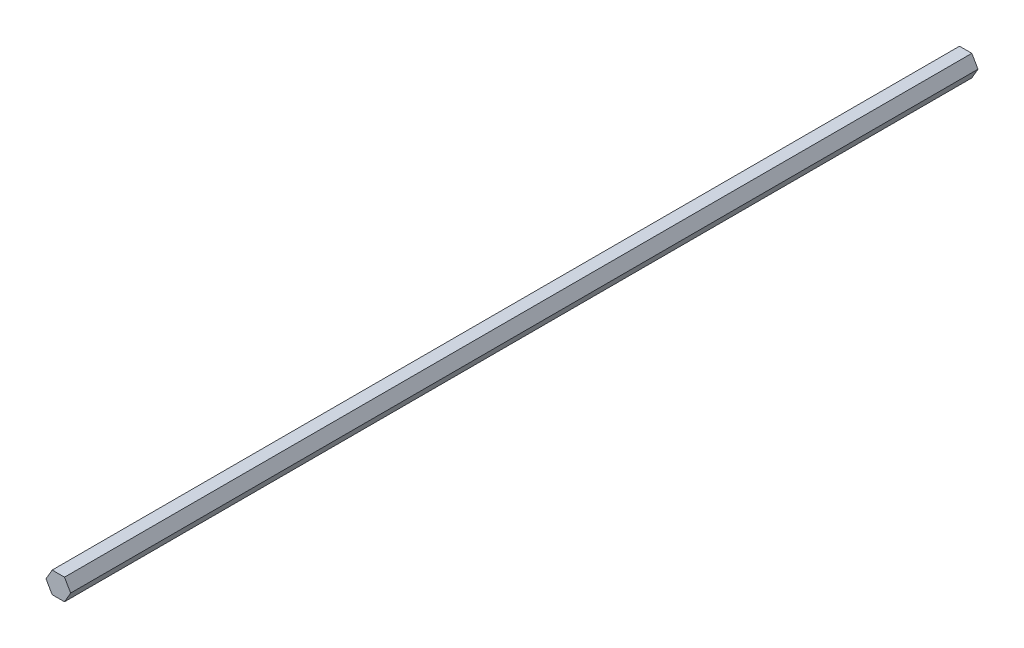
ISO-10303-21;
HEADER;
FILE_DESCRIPTION(('STEP AP214'),'2;1');
FILE_NAME('part.step','',(''),(''),'','','');
FILE_SCHEMA(('AUTOMOTIVE_DESIGN { 1 0 10303 214 1 1 1 1 }'));
ENDSEC;
DATA;
#1=APPLICATION_CONTEXT('core data for automotive mechanical design processes');
#2=APPLICATION_PROTOCOL_DEFINITION('international standard','automotive_design',2000,#1);
#3=PRODUCT_CONTEXT('',#1,'mechanical');
#4=PRODUCT('Part','Part','',(#3));
#5=PRODUCT_RELATED_PRODUCT_CATEGORY('part','',(#4));
#6=PRODUCT_DEFINITION_FORMATION('','',#4);
#7=PRODUCT_DEFINITION_CONTEXT('part definition',#1,'design');
#8=PRODUCT_DEFINITION('design','',#6,#7);
#9=PRODUCT_DEFINITION_SHAPE('','',#8);
#10=(LENGTH_UNIT() NAMED_UNIT(*) SI_UNIT(.MILLI.,.METRE.));
#11=(NAMED_UNIT(*) PLANE_ANGLE_UNIT() SI_UNIT($,.RADIAN.));
#12=(NAMED_UNIT(*) SI_UNIT($,.STERADIAN.) SOLID_ANGLE_UNIT());
#13=UNCERTAINTY_MEASURE_WITH_UNIT(LENGTH_MEASURE(1.E-05),#10,'distance_accuracy_value','');
#14=(GEOMETRIC_REPRESENTATION_CONTEXT(3) GLOBAL_UNCERTAINTY_ASSIGNED_CONTEXT((#13)) GLOBAL_UNIT_ASSIGNED_CONTEXT((#10,
#11,#12)) REPRESENTATION_CONTEXT('',''));
#15=CARTESIAN_POINT('',(0.,0.,0.));
#16=DIRECTION('',(0.,0.,1.));
#17=DIRECTION('',(1.,0.,0.));
#18=AXIS2_PLACEMENT_3D('',#15,#16,#17);
#19=CARTESIAN_POINT('',(3.6661742093542,-6.34999999999996,539.75));
#20=DIRECTION('',(-0.866025403784442,0.499999999999995,0.));
#21=DIRECTION('',(-0.499999999999995,-0.866025403784442,0.));
#22=AXIS2_PLACEMENT_3D('',#19,#20,#21);
#23=PLANE('',#22);
#24=DIRECTION('',(0.499999999999995,0.866025403784442,0.));
#25=VECTOR('',#24,1.);
#26=CARTESIAN_POINT('',(3.6661742093542,-6.34999999999996,0.));
#27=LINE('',#26,#25);
#28=CARTESIAN_POINT('',(3.6661742093542,-6.34999999999996,0.));
#29=VERTEX_POINT('',#28);
#30=CARTESIAN_POINT('',(7.33234841870825,0.,0.));
#31=VERTEX_POINT('',#30);
#32=EDGE_CURVE('E117',#29,#31,#27,.T.);
#33=ORIENTED_EDGE('',*,*,#32,.T.);
#34=DIRECTION('',(0.,0.,-1.));
#35=VECTOR('',#34,1.);
#36=CARTESIAN_POINT('',(7.33234841870825,0.,539.75));
#37=LINE('',#36,#35);
#38=CARTESIAN_POINT('',(7.33234841870825,0.,539.75));
#39=VERTEX_POINT('',#38);
#40=EDGE_CURVE('E11',#39,#31,#37,.T.);
#41=ORIENTED_EDGE('',*,*,#40,.F.);
#42=DIRECTION('',(0.499999999999995,0.866025403784442,0.));
#43=VECTOR('',#42,1.);
#44=CARTESIAN_POINT('',(3.6661742093542,-6.34999999999996,539.75));
#45=LINE('',#44,#43);
#46=CARTESIAN_POINT('',(3.6661742093542,-6.34999999999996,539.75));
#47=VERTEX_POINT('',#46);
#48=EDGE_CURVE('E127',#47,#39,#45,.T.);
#49=ORIENTED_EDGE('',*,*,#48,.F.);
#50=DIRECTION('',(0.,0.,-1.));
#51=VECTOR('',#50,1.);
#52=CARTESIAN_POINT('',(3.6661742093542,-6.34999999999996,539.75));
#53=LINE('',#52,#51);
#54=EDGE_CURVE('E113',#47,#29,#53,.T.);
#55=ORIENTED_EDGE('',*,*,#54,.T.);
#56=EDGE_LOOP('',(#33,#41,#49,#55));
#57=FACE_BOUND('',#56,.T.);
#58=ADVANCED_FACE('F33',(#57),#23,.F.);
#59=CARTESIAN_POINT('',(7.33234841870825,0.,539.75));
#60=DIRECTION('',(-0.866025403784438,-0.500000000000001,0.));
#61=DIRECTION('',(0.500000000000001,-0.866025403784438,0.));
#62=AXIS2_PLACEMENT_3D('',#59,#60,#61);
#63=PLANE('',#62);
#64=DIRECTION('',(-0.500000000000001,0.866025403784438,0.));
#65=VECTOR('',#64,1.);
#66=CARTESIAN_POINT('',(7.33234841870825,0.,0.));
#67=LINE('',#66,#65);
#68=CARTESIAN_POINT('',(3.66617420935411,6.35000000000001,0.));
#69=VERTEX_POINT('',#68);
#70=EDGE_CURVE('E120',#31,#69,#67,.T.);
#71=ORIENTED_EDGE('',*,*,#70,.T.);
#72=DIRECTION('',(0.,0.,-1.));
#73=VECTOR('',#72,1.);
#74=CARTESIAN_POINT('',(3.66617420935411,6.35000000000001,539.75));
#75=LINE('',#74,#73);
#76=CARTESIAN_POINT('',(3.66617420935411,6.35000000000001,539.75));
#77=VERTEX_POINT('',#76);
#78=EDGE_CURVE('E41',#77,#69,#75,.T.);
#79=ORIENTED_EDGE('',*,*,#78,.F.);
#80=DIRECTION('',(-0.500000000000001,0.866025403784438,0.));
#81=VECTOR('',#80,1.);
#82=CARTESIAN_POINT('',(7.33234841870825,0.,539.75));
#83=LINE('',#82,#81);
#84=EDGE_CURVE('E86',#39,#77,#83,.T.);
#85=ORIENTED_EDGE('',*,*,#84,.F.);
#86=ORIENTED_EDGE('',*,*,#40,.T.);
#87=EDGE_LOOP('',(#71,#79,#85,#86));
#88=FACE_BOUND('',#87,.T.);
#89=ADVANCED_FACE('F151',(#88),#63,.F.);
#90=CARTESIAN_POINT('',(3.66617420935411,6.35000000000001,539.75));
#91=DIRECTION('',(0.,-1.,0.));
#92=DIRECTION('',(1.,0.,0.));
#93=AXIS2_PLACEMENT_3D('',#90,#91,#92);
#94=PLANE('',#93);
#95=DIRECTION('',(-1.,0.,0.));
#96=VECTOR('',#95,1.);
#97=CARTESIAN_POINT('',(3.66617420935411,6.35000000000001,0.));
#98=LINE('',#97,#96);
#99=CARTESIAN_POINT('',(-3.66617420935416,6.34999999999999,0.));
#100=VERTEX_POINT('',#99);
#101=EDGE_CURVE('E122',#69,#100,#98,.T.);
#102=ORIENTED_EDGE('',*,*,#101,.T.);
#103=DIRECTION('',(0.,0.,-1.));
#104=VECTOR('',#103,1.);
#105=CARTESIAN_POINT('',(-3.66617420935416,6.34999999999999,539.75));
#106=LINE('',#105,#104);
#107=CARTESIAN_POINT('',(-3.66617420935416,6.34999999999999,539.75));
#108=VERTEX_POINT('',#107);
#109=EDGE_CURVE('E108',#108,#100,#106,.T.);
#110=ORIENTED_EDGE('',*,*,#109,.F.);
#111=DIRECTION('',(-1.,0.,0.));
#112=VECTOR('',#111,1.);
#113=CARTESIAN_POINT('',(3.66617420935411,6.35000000000001,539.75));
#114=LINE('',#113,#112);
#115=EDGE_CURVE('E99',#77,#108,#114,.T.);
#116=ORIENTED_EDGE('',*,*,#115,.F.);
#117=ORIENTED_EDGE('',*,*,#78,.T.);
#118=EDGE_LOOP('',(#102,#110,#116,#117));
#119=FACE_BOUND('',#118,.T.);
#120=ADVANCED_FACE('F133',(#119),#94,.F.);
#121=CARTESIAN_POINT('',(-3.66617420935416,6.34999999999999,539.75));
#122=DIRECTION('',(0.866025403784442,-0.499999999999995,0.));
#123=DIRECTION('',(0.499999999999995,0.866025403784442,0.));
#124=AXIS2_PLACEMENT_3D('',#121,#122,#123);
#125=PLANE('',#124);
#126=DIRECTION('',(-0.499999999999995,-0.866025403784442,0.));
#127=VECTOR('',#126,1.);
#128=CARTESIAN_POINT('',(-3.66617420935416,6.34999999999999,0.));
#129=LINE('',#128,#127);
#130=CARTESIAN_POINT('',(-7.33234841870825,0.,0.));
#131=VERTEX_POINT('',#130);
#132=EDGE_CURVE('E107',#100,#131,#129,.T.);
#133=ORIENTED_EDGE('',*,*,#132,.T.);
#134=DIRECTION('',(0.,0.,-1.));
#135=VECTOR('',#134,1.);
#136=CARTESIAN_POINT('',(-7.33234841870825,0.,539.75));
#137=LINE('',#136,#135);
#138=CARTESIAN_POINT('',(-7.33234841870825,0.,539.75));
#139=VERTEX_POINT('',#138);
#140=EDGE_CURVE('E104',#139,#131,#137,.T.);
#141=ORIENTED_EDGE('',*,*,#140,.F.);
#142=DIRECTION('',(-0.499999999999995,-0.866025403784442,0.));
#143=VECTOR('',#142,1.);
#144=CARTESIAN_POINT('',(-3.66617420935416,6.34999999999999,539.75));
#145=LINE('',#144,#143);
#146=EDGE_CURVE('E93',#108,#139,#145,.T.);
#147=ORIENTED_EDGE('',*,*,#146,.F.);
#148=ORIENTED_EDGE('',*,*,#109,.T.);
#149=EDGE_LOOP('',(#133,#141,#147,#148));
#150=FACE_BOUND('',#149,.T.);
#151=ADVANCED_FACE('F105',(#150),#125,.F.);
#152=CARTESIAN_POINT('',(-7.33234841870825,0.,539.75));
#153=DIRECTION('',(0.866025403784435,0.500000000000007,0.));
#154=DIRECTION('',(-0.500000000000007,0.866025403784435,0.));
#155=AXIS2_PLACEMENT_3D('',#152,#153,#154);
#156=PLANE('',#155);
#157=DIRECTION('',(0.500000000000007,-0.866025403784435,0.));
#158=VECTOR('',#157,1.);
#159=CARTESIAN_POINT('',(-7.33234841870825,0.,0.));
#160=LINE('',#159,#158);
#161=CARTESIAN_POINT('',(-3.66617420935407,-6.35000000000004,0.));
#162=VERTEX_POINT('',#161);
#163=EDGE_CURVE('E72',#131,#162,#160,.T.);
#164=ORIENTED_EDGE('',*,*,#163,.T.);
#165=DIRECTION('',(0.,0.,-1.));
#166=VECTOR('',#165,1.);
#167=CARTESIAN_POINT('',(-3.66617420935407,-6.35000000000004,539.75));
#168=LINE('',#167,#166);
#169=CARTESIAN_POINT('',(-3.66617420935407,-6.35000000000004,539.75));
#170=VERTEX_POINT('',#169);
#171=EDGE_CURVE('E109',#170,#162,#168,.T.);
#172=ORIENTED_EDGE('',*,*,#171,.F.);
#173=DIRECTION('',(0.500000000000007,-0.866025403784435,0.));
#174=VECTOR('',#173,1.);
#175=CARTESIAN_POINT('',(-7.33234841870825,0.,539.75));
#176=LINE('',#175,#174);
#177=EDGE_CURVE('E97',#139,#170,#176,.T.);
#178=ORIENTED_EDGE('',*,*,#177,.F.);
#179=ORIENTED_EDGE('',*,*,#140,.T.);
#180=EDGE_LOOP('',(#164,#172,#178,#179));
#181=FACE_BOUND('',#180,.T.);
#182=ADVANCED_FACE('F111',(#181),#156,.F.);
#183=CARTESIAN_POINT('',(-3.66617420935407,-6.35000000000004,539.75));
#184=DIRECTION('',(0.,1.,0.));
#185=DIRECTION('',(-1.,0.,0.));
#186=AXIS2_PLACEMENT_3D('',#183,#184,#185);
#187=PLANE('',#186);
#188=DIRECTION('',(1.,0.,0.));
#189=VECTOR('',#188,1.);
#190=CARTESIAN_POINT('',(-3.66617420935407,-6.35000000000004,0.));
#191=LINE('',#190,#189);
#192=EDGE_CURVE('E78',#162,#29,#191,.T.);
#193=ORIENTED_EDGE('',*,*,#192,.T.);
#194=ORIENTED_EDGE('',*,*,#54,.F.);
#195=DIRECTION('',(1.,0.,0.));
#196=VECTOR('',#195,1.);
#197=CARTESIAN_POINT('',(-3.66617420935407,-6.35000000000004,539.75));
#198=LINE('',#197,#196);
#199=EDGE_CURVE('E49',#170,#47,#198,.T.);
#200=ORIENTED_EDGE('',*,*,#199,.F.);
#201=ORIENTED_EDGE('',*,*,#171,.T.);
#202=EDGE_LOOP('',(#193,#194,#200,#201));
#203=FACE_BOUND('',#202,.T.);
#204=ADVANCED_FACE('F140',(#203),#187,.F.);
#205=CARTESIAN_POINT('',(0.,0.,539.75));
#206=DIRECTION('',(0.,0.,1.));
#207=DIRECTION('',(1.,0.,0.));
#208=AXIS2_PLACEMENT_3D('',#205,#206,#207);
#209=PLANE('',#208);
#210=ORIENTED_EDGE('',*,*,#48,.T.);
#211=ORIENTED_EDGE('',*,*,#84,.T.);
#212=ORIENTED_EDGE('',*,*,#115,.T.);
#213=ORIENTED_EDGE('',*,*,#146,.T.);
#214=ORIENTED_EDGE('',*,*,#177,.T.);
#215=ORIENTED_EDGE('',*,*,#199,.T.);
#216=EDGE_LOOP('',(#210,#211,#212,#213,#214,#215));
#217=FACE_BOUND('',#216,.T.);
#218=ADVANCED_FACE('F95',(#217),#209,.T.);
#219=CARTESIAN_POINT('',(0.,0.,0.));
#220=DIRECTION('',(0.,0.,1.));
#221=DIRECTION('',(1.,0.,0.));
#222=AXIS2_PLACEMENT_3D('',#219,#220,#221);
#223=PLANE('',#222);
#224=ORIENTED_EDGE('',*,*,#32,.F.);
#225=ORIENTED_EDGE('',*,*,#192,.F.);
#226=ORIENTED_EDGE('',*,*,#163,.F.);
#227=ORIENTED_EDGE('',*,*,#132,.F.);
#228=ORIENTED_EDGE('',*,*,#101,.F.);
#229=ORIENTED_EDGE('',*,*,#70,.F.);
#230=EDGE_LOOP('',(#224,#225,#226,#227,#228,#229));
#231=FACE_BOUND('',#230,.T.);
#232=ADVANCED_FACE('F136',(#231),#223,.F.);
#233=CLOSED_SHELL('',(#58,#89,#120,#151,#182,#204,#218,#232));
#234=MANIFOLD_SOLID_BREP('B2',#233);
#235=ADVANCED_BREP_SHAPE_REPRESENTATION('',(#18,#234),#14);
#236=SHAPE_DEFINITION_REPRESENTATION(#9,#235);
ENDSEC;
END-ISO-10303-21;
